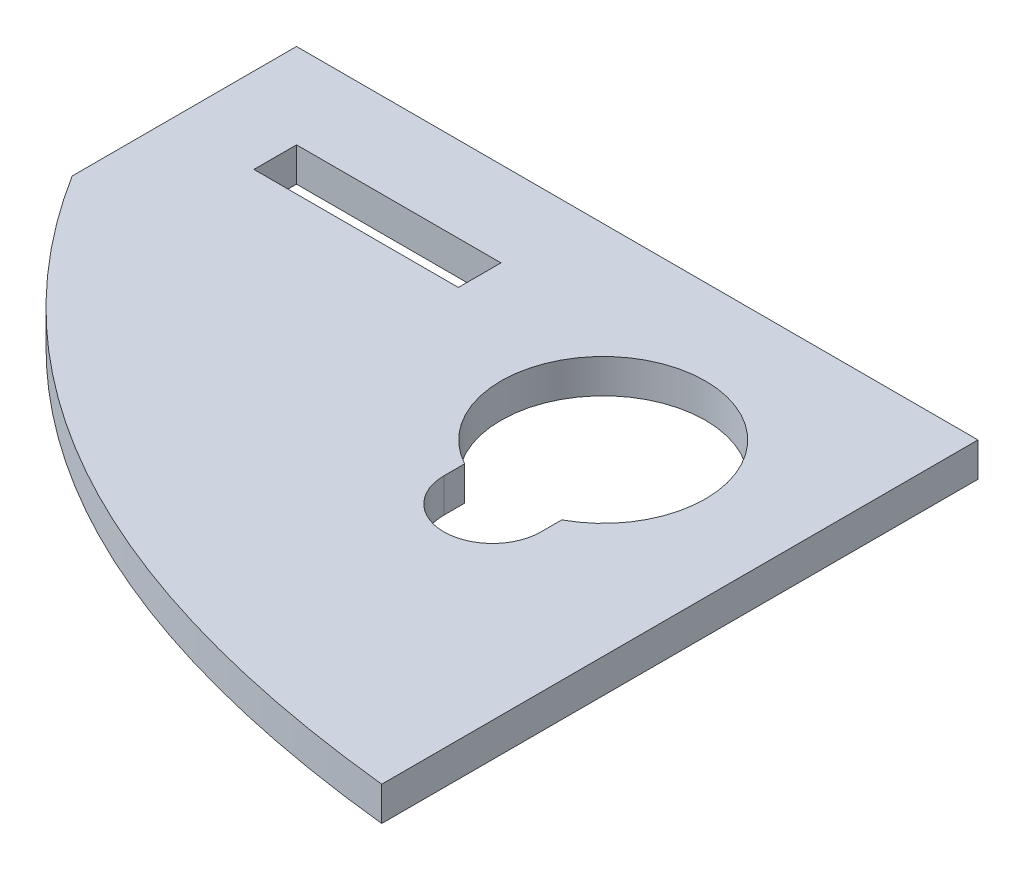
ISO-10303-21;
HEADER;
FILE_DESCRIPTION(('STEP AP214'),'2;1');
FILE_NAME('part.step','',(''),(''),'','','');
FILE_SCHEMA(('AUTOMOTIVE_DESIGN { 1 0 10303 214 1 1 1 1 }'));
ENDSEC;
DATA;
#1=APPLICATION_CONTEXT('core data for automotive mechanical design processes');
#2=APPLICATION_PROTOCOL_DEFINITION('international standard','automotive_design',2000,#1);
#3=PRODUCT_CONTEXT('',#1,'mechanical');
#4=PRODUCT('Part','Part','',(#3));
#5=PRODUCT_RELATED_PRODUCT_CATEGORY('part','',(#4));
#6=PRODUCT_DEFINITION_FORMATION('','',#4);
#7=PRODUCT_DEFINITION_CONTEXT('part definition',#1,'design');
#8=PRODUCT_DEFINITION('design','',#6,#7);
#9=PRODUCT_DEFINITION_SHAPE('','',#8);
#10=(LENGTH_UNIT() NAMED_UNIT(*) SI_UNIT(.MILLI.,.METRE.));
#11=(NAMED_UNIT(*) PLANE_ANGLE_UNIT() SI_UNIT($,.RADIAN.));
#12=(NAMED_UNIT(*) SI_UNIT($,.STERADIAN.) SOLID_ANGLE_UNIT());
#13=UNCERTAINTY_MEASURE_WITH_UNIT(LENGTH_MEASURE(1.E-05),#10,'distance_accuracy_value','');
#14=(GEOMETRIC_REPRESENTATION_CONTEXT(3) GLOBAL_UNCERTAINTY_ASSIGNED_CONTEXT((#13)) GLOBAL_UNIT_ASSIGNED_CONTEXT((#10,
#11,#12)) REPRESENTATION_CONTEXT('',''));
#15=CARTESIAN_POINT('',(0.,0.,0.));
#16=DIRECTION('',(0.,0.,1.));
#17=DIRECTION('',(1.,0.,0.));
#18=AXIS2_PLACEMENT_3D('',#15,#16,#17);
#19=CARTESIAN_POINT('',(0.,2.,0.));
#20=DIRECTION('',(0.,-1.,0.));
#21=DIRECTION('',(0.,0.,-1.));
#22=AXIS2_PLACEMENT_3D('',#19,#20,#21);
#23=PLANE('',#22);
#24=CARTESIAN_POINT('',(9.00000000000001,2.,0.));
#25=DIRECTION('',(0.,1.,0.));
#26=DIRECTION('',(0.,0.,1.));
#27=AXIS2_PLACEMENT_3D('',#24,#25,#26);
#28=CIRCLE('',#27,2.85);
#29=CARTESIAN_POINT('',(6.15000000000001,2.,0.));
#30=VERTEX_POINT('',#29);
#31=CARTESIAN_POINT('',(11.85,2.,0.));
#32=VERTEX_POINT('',#31);
#33=EDGE_CURVE('E202',#30,#32,#28,.T.);
#34=ORIENTED_EDGE('',*,*,#33,.F.);
#35=DIRECTION('',(0.,0.,1.));
#36=VECTOR('',#35,1.);
#37=CARTESIAN_POINT('',(6.15000000000001,2.,-1.2200852279606));
#38=LINE('',#37,#36);
#39=CARTESIAN_POINT('',(6.15000000000001,2.,-1.2200852279606));
#40=VERTEX_POINT('',#39);
#41=EDGE_CURVE('E210',#40,#30,#38,.T.);
#42=ORIENTED_EDGE('',*,*,#41,.F.);
#43=CARTESIAN_POINT('',(9.00000000000001,2.,-6.50000000000001));
#44=DIRECTION('',(0.,1.,0.));
#45=DIRECTION('',(0.,0.,1.));
#46=AXIS2_PLACEMENT_3D('',#43,#44,#45);
#47=CIRCLE('',#46,6.);
#48=CARTESIAN_POINT('',(11.85,2.,-1.2200852279606));
#49=VERTEX_POINT('',#48);
#50=EDGE_CURVE('E207',#49,#40,#47,.T.);
#51=ORIENTED_EDGE('',*,*,#50,.F.);
#52=DIRECTION('',(0.,0.,-1.));
#53=VECTOR('',#52,1.);
#54=CARTESIAN_POINT('',(11.85,2.,-1.2200852279606));
#55=LINE('',#54,#53);
#56=EDGE_CURVE('E204',#32,#49,#55,.T.);
#57=ORIENTED_EDGE('',*,*,#56,.F.);
#58=EDGE_LOOP('',(#34,#42,#51,#57));
#59=FACE_BOUND('',#58,.T.);
#60=DIRECTION('',(0.,0.,1.));
#61=VECTOR('',#60,1.);
#62=CARTESIAN_POINT('',(-20.,2.,17.5));
#63=LINE('',#62,#61);
#64=CARTESIAN_POINT('',(-20.,2.,-17.5));
#65=VERTEX_POINT('',#64);
#66=CARTESIAN_POINT('',(-19.9999999902545,2.,-4.33251585533588));
#67=VERTEX_POINT('',#66);
#68=EDGE_CURVE('E134',#65,#67,#63,.T.);
#69=ORIENTED_EDGE('',*,*,#68,.T.);
#70=CARTESIAN_POINT('',(20.,2.,17.5));
#71=CARTESIAN_POINT('',(-13.8367991539517,2.,13.8981504169357));
#72=CARTESIAN_POINT('',(-24.036917243663,2.,-12.4527879235643));
#73=B_SPLINE_CURVE_WITH_KNOTS('',2,(#70,#71,#72),.UNSPECIFIED.,.F.,.F.,(3,3),(0.,1.),.UNSPECIFIED.);
#74=CARTESIAN_POINT('',(20.,2.,17.5));
#75=VERTEX_POINT('',#74);
#76=EDGE_CURVE('E126',#75,#67,#73,.T.);
#77=ORIENTED_EDGE('',*,*,#76,.F.);
#78=DIRECTION('',(0.,0.,-1.));
#79=VECTOR('',#78,1.);
#80=CARTESIAN_POINT('',(20.,2.,17.5));
#81=LINE('',#80,#79);
#82=CARTESIAN_POINT('',(20.,2.,-17.5));
#83=VERTEX_POINT('',#82);
#84=EDGE_CURVE('E140',#75,#83,#81,.T.);
#85=ORIENTED_EDGE('',*,*,#84,.T.);
#86=DIRECTION('',(-1.,0.,0.));
#87=VECTOR('',#86,1.);
#88=CARTESIAN_POINT('',(-20.,2.,-17.5));
#89=LINE('',#88,#87);
#90=EDGE_CURVE('E145',#83,#65,#89,.T.);
#91=ORIENTED_EDGE('',*,*,#90,.T.);
#92=EDGE_LOOP('',(#69,#77,#85,#91));
#93=FACE_BOUND('',#92,.T.);
#94=DIRECTION('',(0.,0.,1.));
#95=VECTOR('',#94,1.);
#96=CARTESIAN_POINT('',(-15.,2.,-10.));
#97=LINE('',#96,#95);
#98=CARTESIAN_POINT('',(-15.,2.,-12.5));
#99=VERTEX_POINT('',#98);
#100=CARTESIAN_POINT('',(-15.,2.,-10.));
#101=VERTEX_POINT('',#100);
#102=EDGE_CURVE('E175',#99,#101,#97,.T.);
#103=ORIENTED_EDGE('',*,*,#102,.F.);
#104=DIRECTION('',(-1.,0.,0.));
#105=VECTOR('',#104,1.);
#106=CARTESIAN_POINT('',(-15.,2.,-12.5));
#107=LINE('',#106,#105);
#108=CARTESIAN_POINT('',(-2.99999999999999,2.,-12.5));
#109=VERTEX_POINT('',#108);
#110=EDGE_CURVE('E185',#109,#99,#107,.T.);
#111=ORIENTED_EDGE('',*,*,#110,.F.);
#112=DIRECTION('',(0.,0.,-1.));
#113=VECTOR('',#112,1.);
#114=CARTESIAN_POINT('',(-2.99999999999999,2.,-10.));
#115=LINE('',#114,#113);
#116=CARTESIAN_POINT('',(-2.99999999999999,2.,-10.));
#117=VERTEX_POINT('',#116);
#118=EDGE_CURVE('E183',#117,#109,#115,.T.);
#119=ORIENTED_EDGE('',*,*,#118,.F.);
#120=DIRECTION('',(1.,0.,0.));
#121=VECTOR('',#120,1.);
#122=CARTESIAN_POINT('',(-15.,2.,-10.));
#123=LINE('',#122,#121);
#124=EDGE_CURVE('E180',#101,#117,#123,.T.);
#125=ORIENTED_EDGE('',*,*,#124,.F.);
#126=EDGE_LOOP('',(#103,#111,#119,#125));
#127=FACE_BOUND('',#126,.T.);
#128=ADVANCED_FACE('F33',(#59,#93,#127),#23,.F.);
#129=CARTESIAN_POINT('',(0.,0.,0.));
#130=DIRECTION('',(0.,-1.,0.));
#131=DIRECTION('',(0.,0.,-1.));
#132=AXIS2_PLACEMENT_3D('',#129,#130,#131);
#133=PLANE('',#132);
#134=CARTESIAN_POINT('',(20.,0.,17.5));
#135=CARTESIAN_POINT('',(-13.8367991539517,0.,13.8981504169357));
#136=CARTESIAN_POINT('',(-24.036917243663,0.,-12.4527879235643));
#137=B_SPLINE_CURVE_WITH_KNOTS('',2,(#134,#135,#136),.UNSPECIFIED.,.F.,.F.,(3,3),(0.,1.),.UNSPECIFIED.);
#138=CARTESIAN_POINT('',(-20.,0.,-4.33251587091376));
#139=VERTEX_POINT('',#138);
#140=CARTESIAN_POINT('',(20.,0.,17.5));
#141=VERTEX_POINT('',#140);
#142=EDGE_CURVE('E129',#139,#141,#137,.F.);
#143=ORIENTED_EDGE('',*,*,#142,.F.);
#144=DIRECTION('',(0.,0.,1.));
#145=VECTOR('',#144,1.);
#146=CARTESIAN_POINT('',(-20.,0.,17.5));
#147=LINE('',#146,#145);
#148=CARTESIAN_POINT('',(-20.,0.,-17.5));
#149=VERTEX_POINT('',#148);
#150=EDGE_CURVE('E146',#149,#139,#147,.T.);
#151=ORIENTED_EDGE('',*,*,#150,.F.);
#152=DIRECTION('',(-1.,0.,0.));
#153=VECTOR('',#152,1.);
#154=CARTESIAN_POINT('',(-20.,0.,-17.5));
#155=LINE('',#154,#153);
#156=CARTESIAN_POINT('',(20.,0.,-17.5));
#157=VERTEX_POINT('',#156);
#158=EDGE_CURVE('E150',#157,#149,#155,.T.);
#159=ORIENTED_EDGE('',*,*,#158,.F.);
#160=DIRECTION('',(0.,0.,-1.));
#161=VECTOR('',#160,1.);
#162=CARTESIAN_POINT('',(20.,0.,17.5));
#163=LINE('',#162,#161);
#164=EDGE_CURVE('E157',#141,#157,#163,.T.);
#165=ORIENTED_EDGE('',*,*,#164,.F.);
#166=EDGE_LOOP('',(#143,#151,#159,#165));
#167=FACE_BOUND('',#166,.T.);
#168=DIRECTION('',(0.,0.,1.));
#169=VECTOR('',#168,1.);
#170=CARTESIAN_POINT('',(6.15000000000001,0.,-1.2200852279606));
#171=LINE('',#170,#169);
#172=CARTESIAN_POINT('',(6.15,0.,-1.2200852279606));
#173=VERTEX_POINT('',#172);
#174=CARTESIAN_POINT('',(6.15000000000001,0.,0.));
#175=VERTEX_POINT('',#174);
#176=EDGE_CURVE('E205',#173,#175,#171,.T.);
#177=ORIENTED_EDGE('',*,*,#176,.T.);
#178=CARTESIAN_POINT('',(9.00000000000001,0.,0.));
#179=DIRECTION('',(0.,1.,0.));
#180=DIRECTION('',(0.,0.,1.));
#181=AXIS2_PLACEMENT_3D('',#178,#179,#180);
#182=CIRCLE('',#181,2.85);
#183=CARTESIAN_POINT('',(11.85,0.,0.));
#184=VERTEX_POINT('',#183);
#185=EDGE_CURVE('E201',#175,#184,#182,.T.);
#186=ORIENTED_EDGE('',*,*,#185,.T.);
#187=DIRECTION('',(0.,0.,-1.));
#188=VECTOR('',#187,1.);
#189=CARTESIAN_POINT('',(11.85,0.,-1.2200852279606));
#190=LINE('',#189,#188);
#191=CARTESIAN_POINT('',(11.85,0.,-1.2200852279606));
#192=VERTEX_POINT('',#191);
#193=EDGE_CURVE('E215',#184,#192,#190,.T.);
#194=ORIENTED_EDGE('',*,*,#193,.T.);
#195=CARTESIAN_POINT('',(9.00000000000001,0.,-6.50000000000001));
#196=DIRECTION('',(0.,1.,0.));
#197=DIRECTION('',(0.,0.,1.));
#198=AXIS2_PLACEMENT_3D('',#195,#196,#197);
#199=CIRCLE('',#198,6.);
#200=EDGE_CURVE('E218',#192,#173,#199,.T.);
#201=ORIENTED_EDGE('',*,*,#200,.T.);
#202=EDGE_LOOP('',(#177,#186,#194,#201));
#203=FACE_BOUND('',#202,.T.);
#204=DIRECTION('',(-1.,0.,0.));
#205=VECTOR('',#204,1.);
#206=CARTESIAN_POINT('',(-15.,0.,-12.5));
#207=LINE('',#206,#205);
#208=CARTESIAN_POINT('',(-2.99999999999999,0.,-12.5));
#209=VERTEX_POINT('',#208);
#210=CARTESIAN_POINT('',(-15.,0.,-12.5));
#211=VERTEX_POINT('',#210);
#212=EDGE_CURVE('E181',#209,#211,#207,.T.);
#213=ORIENTED_EDGE('',*,*,#212,.T.);
#214=DIRECTION('',(0.,0.,1.));
#215=VECTOR('',#214,1.);
#216=CARTESIAN_POINT('',(-15.,0.,-10.));
#217=LINE('',#216,#215);
#218=CARTESIAN_POINT('',(-15.,0.,-10.));
#219=VERTEX_POINT('',#218);
#220=EDGE_CURVE('E56',#211,#219,#217,.T.);
#221=ORIENTED_EDGE('',*,*,#220,.T.);
#222=DIRECTION('',(1.,0.,0.));
#223=VECTOR('',#222,1.);
#224=CARTESIAN_POINT('',(-15.,0.,-10.));
#225=LINE('',#224,#223);
#226=CARTESIAN_POINT('',(-2.99999999999999,0.,-10.));
#227=VERTEX_POINT('',#226);
#228=EDGE_CURVE('E169',#219,#227,#225,.T.);
#229=ORIENTED_EDGE('',*,*,#228,.T.);
#230=DIRECTION('',(0.,0.,-1.));
#231=VECTOR('',#230,1.);
#232=CARTESIAN_POINT('',(-2.99999999999999,0.,-10.));
#233=LINE('',#232,#231);
#234=EDGE_CURVE('E190',#227,#209,#233,.T.);
#235=ORIENTED_EDGE('',*,*,#234,.T.);
#236=EDGE_LOOP('',(#213,#221,#229,#235));
#237=FACE_BOUND('',#236,.T.);
#238=ADVANCED_FACE('F166',(#167,#203,#237),#133,.T.);
#239=CARTESIAN_POINT('',(20.,2.,17.5));
#240=DIRECTION('',(-1.,0.,0.));
#241=DIRECTION('',(0.,0.,1.));
#242=AXIS2_PLACEMENT_3D('',#239,#240,#241);
#243=PLANE('',#242);
#244=ORIENTED_EDGE('',*,*,#164,.T.);
#245=DIRECTION('',(0.,-1.,0.));
#246=VECTOR('',#245,1.);
#247=CARTESIAN_POINT('',(20.,2.,-17.5));
#248=LINE('',#247,#246);
#249=EDGE_CURVE('E11',#83,#157,#248,.T.);
#250=ORIENTED_EDGE('',*,*,#249,.F.);
#251=ORIENTED_EDGE('',*,*,#84,.F.);
#252=DIRECTION('',(0.,-1.,0.));
#253=VECTOR('',#252,1.);
#254=CARTESIAN_POINT('',(20.,2.,17.5));
#255=LINE('',#254,#253);
#256=EDGE_CURVE('E123',#75,#141,#255,.T.);
#257=ORIENTED_EDGE('',*,*,#256,.T.);
#258=EDGE_LOOP('',(#244,#250,#251,#257));
#259=FACE_BOUND('',#258,.T.);
#260=ADVANCED_FACE('F35',(#259),#243,.F.);
#261=CARTESIAN_POINT('',(-20.,2.,-17.5));
#262=DIRECTION('',(0.,0.,1.));
#263=DIRECTION('',(1.,0.,0.));
#264=AXIS2_PLACEMENT_3D('',#261,#262,#263);
#265=PLANE('',#264);
#266=ORIENTED_EDGE('',*,*,#158,.T.);
#267=DIRECTION('',(0.,-1.,0.));
#268=VECTOR('',#267,1.);
#269=CARTESIAN_POINT('',(-20.,2.,-17.5));
#270=LINE('',#269,#268);
#271=EDGE_CURVE('E41',#65,#149,#270,.T.);
#272=ORIENTED_EDGE('',*,*,#271,.F.);
#273=ORIENTED_EDGE('',*,*,#90,.F.);
#274=ORIENTED_EDGE('',*,*,#249,.T.);
#275=EDGE_LOOP('',(#266,#272,#273,#274));
#276=FACE_BOUND('',#275,.T.);
#277=ADVANCED_FACE('F265',(#276),#265,.F.);
#278=CARTESIAN_POINT('',(-20.,2.,17.5));
#279=DIRECTION('',(1.,0.,0.));
#280=DIRECTION('',(0.,0.,-1.));
#281=AXIS2_PLACEMENT_3D('',#278,#279,#280);
#282=PLANE('',#281);
#283=ORIENTED_EDGE('',*,*,#150,.T.);
#284=DIRECTION('',(0.,1.,0.));
#285=VECTOR('',#284,1.);
#286=CARTESIAN_POINT('',(-20.,-8.,-4.33251587091376));
#287=LINE('',#286,#285);
#288=EDGE_CURVE('E143',#139,#67,#287,.T.);
#289=ORIENTED_EDGE('',*,*,#288,.T.);
#290=ORIENTED_EDGE('',*,*,#68,.F.);
#291=ORIENTED_EDGE('',*,*,#271,.T.);
#292=EDGE_LOOP('',(#283,#289,#290,#291));
#293=FACE_BOUND('',#292,.T.);
#294=ADVANCED_FACE('F163',(#293),#282,.F.);
#295=CARTESIAN_POINT('',(9.00000000000001,2.,0.));
#296=DIRECTION('',(0.,-1.,0.));
#297=DIRECTION('',(0.,0.,-1.));
#298=AXIS2_PLACEMENT_3D('',#295,#296,#297);
#299=CYLINDRICAL_SURFACE('',#298,2.85);
#300=ORIENTED_EDGE('',*,*,#185,.F.);
#301=DIRECTION('',(0.,-1.,0.));
#302=VECTOR('',#301,1.);
#303=CARTESIAN_POINT('',(6.15000000000001,2.,0.));
#304=LINE('',#303,#302);
#305=EDGE_CURVE('E212',#30,#175,#304,.T.);
#306=ORIENTED_EDGE('',*,*,#305,.F.);
#307=ORIENTED_EDGE('',*,*,#33,.T.);
#308=DIRECTION('',(0.,-1.,0.));
#309=VECTOR('',#308,1.);
#310=CARTESIAN_POINT('',(11.85,2.,0.));
#311=LINE('',#310,#309);
#312=EDGE_CURVE('E153',#32,#184,#311,.T.);
#313=ORIENTED_EDGE('',*,*,#312,.T.);
#314=EDGE_LOOP('',(#300,#306,#307,#313));
#315=FACE_BOUND('',#314,.T.);
#316=ADVANCED_FACE('F233',(#315),#299,.F.);
#317=CARTESIAN_POINT('',(11.85,2.,-1.2200852279606));
#318=DIRECTION('',(-1.,0.,0.));
#319=DIRECTION('',(0.,0.,1.));
#320=AXIS2_PLACEMENT_3D('',#317,#318,#319);
#321=PLANE('',#320);
#322=ORIENTED_EDGE('',*,*,#193,.F.);
#323=ORIENTED_EDGE('',*,*,#312,.F.);
#324=ORIENTED_EDGE('',*,*,#56,.T.);
#325=DIRECTION('',(0.,-1.,0.));
#326=VECTOR('',#325,1.);
#327=CARTESIAN_POINT('',(11.85,2.,-1.2200852279606));
#328=LINE('',#327,#326);
#329=EDGE_CURVE('E226',#49,#192,#328,.T.);
#330=ORIENTED_EDGE('',*,*,#329,.T.);
#331=EDGE_LOOP('',(#322,#323,#324,#330));
#332=FACE_BOUND('',#331,.T.);
#333=ADVANCED_FACE('F244',(#332),#321,.T.);
#334=CARTESIAN_POINT('',(9.00000000000001,2.,-6.50000000000001));
#335=DIRECTION('',(0.,-1.,0.));
#336=DIRECTION('',(0.,0.,-1.));
#337=AXIS2_PLACEMENT_3D('',#334,#335,#336);
#338=CYLINDRICAL_SURFACE('',#337,6.);
#339=ORIENTED_EDGE('',*,*,#200,.F.);
#340=ORIENTED_EDGE('',*,*,#329,.F.);
#341=ORIENTED_EDGE('',*,*,#50,.T.);
#342=DIRECTION('',(0.,-1.,0.));
#343=VECTOR('',#342,1.);
#344=CARTESIAN_POINT('',(6.15,2.,-1.2200852279606));
#345=LINE('',#344,#343);
#346=EDGE_CURVE('E225',#40,#173,#345,.T.);
#347=ORIENTED_EDGE('',*,*,#346,.T.);
#348=EDGE_LOOP('',(#339,#340,#341,#347));
#349=FACE_BOUND('',#348,.T.);
#350=ADVANCED_FACE('F246',(#349),#338,.F.);
#351=CARTESIAN_POINT('',(6.15000000000001,2.,-1.2200852279606));
#352=DIRECTION('',(1.,0.,0.));
#353=DIRECTION('',(0.,0.,-1.));
#354=AXIS2_PLACEMENT_3D('',#351,#352,#353);
#355=PLANE('',#354);
#356=ORIENTED_EDGE('',*,*,#176,.F.);
#357=ORIENTED_EDGE('',*,*,#346,.F.);
#358=ORIENTED_EDGE('',*,*,#41,.T.);
#359=ORIENTED_EDGE('',*,*,#305,.T.);
#360=EDGE_LOOP('',(#356,#357,#358,#359));
#361=FACE_BOUND('',#360,.T.);
#362=ADVANCED_FACE('F240',(#361),#355,.T.);
#363=CARTESIAN_POINT('',(-15.,2.,-10.));
#364=DIRECTION('',(1.,0.,0.));
#365=DIRECTION('',(0.,0.,-1.));
#366=AXIS2_PLACEMENT_3D('',#363,#364,#365);
#367=PLANE('',#366);
#368=ORIENTED_EDGE('',*,*,#220,.F.);
#369=DIRECTION('',(0.,-1.,0.));
#370=VECTOR('',#369,1.);
#371=CARTESIAN_POINT('',(-15.,2.,-12.5));
#372=LINE('',#371,#370);
#373=EDGE_CURVE('E186',#99,#211,#372,.T.);
#374=ORIENTED_EDGE('',*,*,#373,.F.);
#375=ORIENTED_EDGE('',*,*,#102,.T.);
#376=DIRECTION('',(0.,-1.,0.));
#377=VECTOR('',#376,1.);
#378=CARTESIAN_POINT('',(-15.,2.,-10.));
#379=LINE('',#378,#377);
#380=EDGE_CURVE('E199',#101,#219,#379,.T.);
#381=ORIENTED_EDGE('',*,*,#380,.T.);
#382=EDGE_LOOP('',(#368,#374,#375,#381));
#383=FACE_BOUND('',#382,.T.);
#384=ADVANCED_FACE('F253',(#383),#367,.T.);
#385=CARTESIAN_POINT('',(-15.,2.,-10.));
#386=DIRECTION('',(0.,0.,-1.));
#387=DIRECTION('',(-1.,0.,0.));
#388=AXIS2_PLACEMENT_3D('',#385,#386,#387);
#389=PLANE('',#388);
#390=ORIENTED_EDGE('',*,*,#228,.F.);
#391=ORIENTED_EDGE('',*,*,#380,.F.);
#392=ORIENTED_EDGE('',*,*,#124,.T.);
#393=DIRECTION('',(0.,-1.,0.));
#394=VECTOR('',#393,1.);
#395=CARTESIAN_POINT('',(-2.99999999999999,2.,-10.));
#396=LINE('',#395,#394);
#397=EDGE_CURVE('E197',#117,#227,#396,.T.);
#398=ORIENTED_EDGE('',*,*,#397,.T.);
#399=EDGE_LOOP('',(#390,#391,#392,#398));
#400=FACE_BOUND('',#399,.T.);
#401=ADVANCED_FACE('F302',(#400),#389,.T.);
#402=CARTESIAN_POINT('',(-2.99999999999999,2.,-10.));
#403=DIRECTION('',(-1.,0.,0.));
#404=DIRECTION('',(0.,0.,1.));
#405=AXIS2_PLACEMENT_3D('',#402,#403,#404);
#406=PLANE('',#405);
#407=ORIENTED_EDGE('',*,*,#234,.F.);
#408=ORIENTED_EDGE('',*,*,#397,.F.);
#409=ORIENTED_EDGE('',*,*,#118,.T.);
#410=DIRECTION('',(0.,-1.,0.));
#411=VECTOR('',#410,1.);
#412=CARTESIAN_POINT('',(-2.99999999999999,2.,-12.5));
#413=LINE('',#412,#411);
#414=EDGE_CURVE('E48',#109,#209,#413,.T.);
#415=ORIENTED_EDGE('',*,*,#414,.T.);
#416=EDGE_LOOP('',(#407,#408,#409,#415));
#417=FACE_BOUND('',#416,.T.);
#418=ADVANCED_FACE('F291',(#417),#406,.T.);
#419=CARTESIAN_POINT('',(-15.,2.,-12.5));
#420=DIRECTION('',(0.,0.,1.));
#421=DIRECTION('',(1.,0.,0.));
#422=AXIS2_PLACEMENT_3D('',#419,#420,#421);
#423=PLANE('',#422);
#424=ORIENTED_EDGE('',*,*,#212,.F.);
#425=ORIENTED_EDGE('',*,*,#414,.F.);
#426=ORIENTED_EDGE('',*,*,#110,.T.);
#427=ORIENTED_EDGE('',*,*,#373,.T.);
#428=EDGE_LOOP('',(#424,#425,#426,#427));
#429=FACE_BOUND('',#428,.T.);
#430=ADVANCED_FACE('F286',(#429),#423,.T.);
#431=CARTESIAN_POINT('',(20.,-8.,17.5));
#432=CARTESIAN_POINT('',(-13.8367991539517,-8.,13.8981504169357));
#433=CARTESIAN_POINT('',(-24.036917243663,-8.,-12.4527879235643));
#434=B_SPLINE_CURVE_WITH_KNOTS('',2,(#431,#432,#433),.UNSPECIFIED.,.F.,.F.,(3,3),(0.,1.),.UNSPECIFIED.);
#435=DIRECTION('',(0.,1.,0.));
#436=VECTOR('',#435,1.);
#437=SURFACE_OF_LINEAR_EXTRUSION('',#434,#436);
#438=ORIENTED_EDGE('',*,*,#142,.T.);
#439=ORIENTED_EDGE('',*,*,#256,.F.);
#440=ORIENTED_EDGE('',*,*,#76,.T.);
#441=ORIENTED_EDGE('',*,*,#288,.F.);
#442=EDGE_LOOP('',(#438,#439,#440,#441));
#443=FACE_BOUND('',#442,.T.);
#444=ADVANCED_FACE('F125',(#443),#437,.F.);
#445=CLOSED_SHELL('',(#128,#238,#260,#277,#294,#316,#333,#350,#362,#384,#401,#418,#430,#444));
#446=MANIFOLD_SOLID_BREP('B2',#445);
#447=ADVANCED_BREP_SHAPE_REPRESENTATION('',(#18,#446),#14);
#448=SHAPE_DEFINITION_REPRESENTATION(#9,#447);
ENDSEC;
END-ISO-10303-21;
